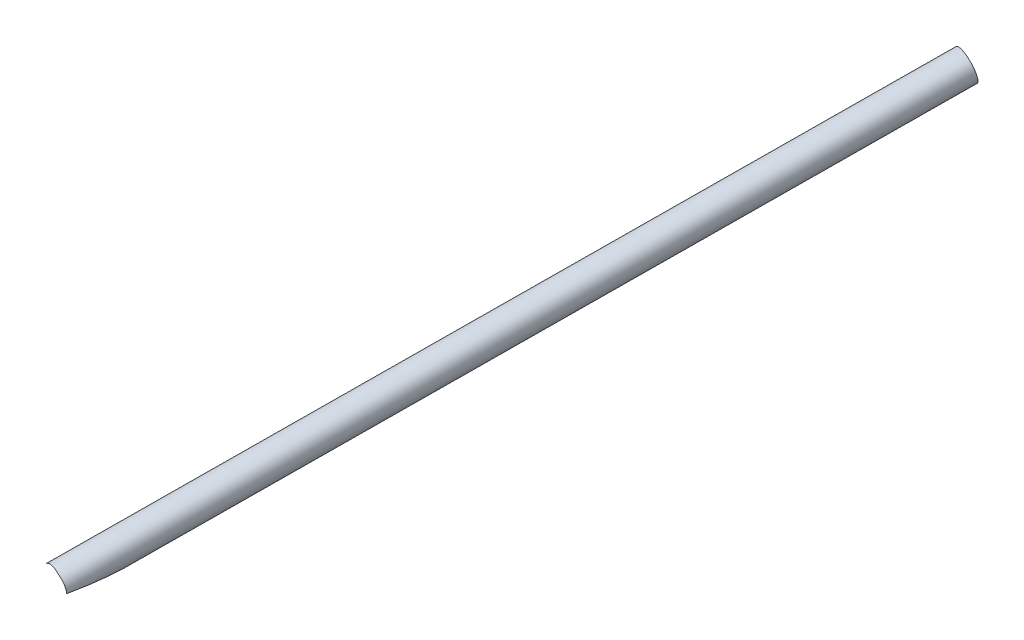
ISO-10303-21;
HEADER;
FILE_DESCRIPTION(('STEP AP214'),'2;1');
FILE_NAME('part.step','',(''),(''),'','','');
FILE_SCHEMA(('AUTOMOTIVE_DESIGN { 1 0 10303 214 1 1 1 1 }'));
ENDSEC;
DATA;
#1=APPLICATION_CONTEXT('core data for automotive mechanical design processes');
#2=APPLICATION_PROTOCOL_DEFINITION('international standard','automotive_design',2000,#1);
#3=PRODUCT_CONTEXT('',#1,'mechanical');
#4=PRODUCT('Part','Part','',(#3));
#5=PRODUCT_RELATED_PRODUCT_CATEGORY('part','',(#4));
#6=PRODUCT_DEFINITION_FORMATION('','',#4);
#7=PRODUCT_DEFINITION_CONTEXT('part definition',#1,'design');
#8=PRODUCT_DEFINITION('design','',#6,#7);
#9=PRODUCT_DEFINITION_SHAPE('','',#8);
#10=(LENGTH_UNIT() NAMED_UNIT(*) SI_UNIT(.MILLI.,.METRE.));
#11=(NAMED_UNIT(*) PLANE_ANGLE_UNIT() SI_UNIT($,.RADIAN.));
#12=(NAMED_UNIT(*) SI_UNIT($,.STERADIAN.) SOLID_ANGLE_UNIT());
#13=UNCERTAINTY_MEASURE_WITH_UNIT(LENGTH_MEASURE(1.E-05),#10,'distance_accuracy_value','');
#14=(GEOMETRIC_REPRESENTATION_CONTEXT(3) GLOBAL_UNCERTAINTY_ASSIGNED_CONTEXT((#13)) GLOBAL_UNIT_ASSIGNED_CONTEXT((#10,
#11,#12)) REPRESENTATION_CONTEXT('',''));
#15=CARTESIAN_POINT('',(0.,0.,0.));
#16=DIRECTION('',(0.,0.,1.));
#17=DIRECTION('',(1.,0.,0.));
#18=AXIS2_PLACEMENT_3D('',#15,#16,#17);
#19=CARTESIAN_POINT('',(74.,0.,457.2));
#20=DIRECTION('',(0.,0.,-1.));
#21=DIRECTION('',(-1.,0.,0.));
#22=AXIS2_PLACEMENT_3D('',#19,#20,#21);
#23=CYLINDRICAL_SURFACE('',#22,9.52500000000001);
#24=CARTESIAN_POINT('',(74.,0.,457.2));
#25=DIRECTION('',(0.13875217529052,0.133928158846882,-0.981229372837989));
#26=DIRECTION('',(0.705998161317945,0.68145262369127,0.192844284022023));
#27=AXIS2_PLACEMENT_3D('',#24,#25,#26);
#28=ELLIPSE('',#27,9.70721042772196,9.525);
#29=CARTESIAN_POINT('',(83.524271376684,-0.117812322268082,458.530713307516));
#30=VERTEX_POINT('',#29);
#31=CARTESIAN_POINT('',(78.3709263667531,8.462897121933,458.973179462046));
#32=VERTEX_POINT('',#31);
#33=EDGE_CURVE('E73',#30,#32,#28,.F.);
#34=ORIENTED_EDGE('',*,*,#33,.T.);
#35=CARTESIAN_POINT('',(74.,0.,457.2));
#36=DIRECTION('',(-0.863745042896468,0.478942715409442,-0.156711123498012));
#37=DIRECTION('',(-0.137051802029349,0.0759946036802452,0.987644482479394));
#38=AXIS2_PLACEMENT_3D('',#35,#36,#37);
#39=ELLIPSE('',#38,60.7806248043446,9.525);
#40=CARTESIAN_POINT('',(78.6189994934439,8.33009415790513,457.2));
#41=VERTEX_POINT('',#40);
#42=EDGE_CURVE('E81',#41,#32,#39,.F.);
#43=ORIENTED_EDGE('',*,*,#42,.F.);
#44=CARTESIAN_POINT('',(74.,0.,457.2));
#45=DIRECTION('',(-0.137051802029349,0.0759946036802452,0.987644482479394));
#46=DIRECTION('',(-0.863745042896468,0.478942715409442,-0.156711123498012));
#47=AXIS2_PLACEMENT_3D('',#44,#45,#46);
#48=ELLIPSE('',#47,9.64415857018543,9.525);
#49=EDGE_CURVE('E46',#30,#41,#48,.T.);
#50=ORIENTED_EDGE('',*,*,#49,.F.);
#51=EDGE_LOOP('',(#34,#43,#50));
#52=FACE_BOUND('',#51,.T.);
#53=ADVANCED_FACE('F36',(#52),#23,.F.);
#54=CARTESIAN_POINT('',(204.165057136812,-72.1759348192314,0.));
#55=DIRECTION('',(-0.270716912176289,0.150111302046005,0.950883247543982));
#56=DIRECTION('',(0.961781089140046,0.,0.273819532854372));
#57=AXIS2_PLACEMENT_3D('',#54,#55,#56);
#58=CYLINDRICAL_SURFACE('',#57,9.52499999999999);
#59=CARTESIAN_POINT('',(73.9999999999999,0.,457.2));
#60=DIRECTION('',(0.277508363855037,0.0576045139736906,-0.958994696523581));
#61=DIRECTION('',(0.00381544954876417,0.998126854994749,0.061059181807759));
#62=AXIS2_PLACEMENT_3D('',#59,#60,#61);
#63=ELLIPSE('',#62,9.73556956140376,9.52499999999999);
#64=CARTESIAN_POINT('',(67.5903171408937,7.0456788633656,455.768419928183));
#65=VERTEX_POINT('',#64);
#66=EDGE_CURVE('E83',#32,#65,#63,.F.);
#67=ORIENTED_EDGE('',*,*,#66,.T.);
#68=CARTESIAN_POINT('',(74.,0.,457.2));
#69=DIRECTION('',(-0.137051802029349,0.0759946036802452,0.987644482479394));
#70=DIRECTION('',(-0.863745042896468,0.478942715409442,-0.156711123498012));
#71=AXIS2_PLACEMENT_3D('',#68,#69,#70);
#72=ELLIPSE('',#71,9.64415857018543,9.525);
#73=EDGE_CURVE('E79',#65,#41,#72,.F.);
#74=ORIENTED_EDGE('',*,*,#73,.T.);
#75=ORIENTED_EDGE('',*,*,#42,.T.);
#76=EDGE_LOOP('',(#67,#74,#75));
#77=FACE_BOUND('',#76,.T.);
#78=ADVANCED_FACE('F80',(#77),#58,.F.);
#79=CARTESIAN_POINT('',(74.,0.,457.2));
#80=DIRECTION('',(-0.863745042896468,0.478942715409442,-0.156711123498012));
#81=DIRECTION('',(-0.137051802029349,0.0759946036802452,0.987644482479394));
#82=AXIS2_PLACEMENT_3D('',#79,#80,#81);
#83=ELLIPSE('',#82,60.7806248043446,9.525);
#84=CARTESIAN_POINT('',(79.5287224915534,7.75621380645162,450.431976644682));
#85=VERTEX_POINT('',#84);
#86=EDGE_CURVE('E11',#41,#85,#83,.T.);
#87=ORIENTED_EDGE('',*,*,#86,.F.);
#88=ORIENTED_EDGE('',*,*,#73,.F.);
#89=CARTESIAN_POINT('',(74.,0.,457.2));
#90=DIRECTION('',(0.705998161317945,0.68145262369127,0.192844284022023));
#91=DIRECTION('',(0.13875217529052,0.133928158846882,-0.981229372837989));
#92=AXIS2_PLACEMENT_3D('',#89,#90,#91);
#93=ELLIPSE('',#92,49.3921821344324,9.525);
#94=CARTESIAN_POINT('',(83.1702232239573,2.57538948953245,414.527401735599));
#95=VERTEX_POINT('',#94);
#96=EDGE_CURVE('E93',#65,#95,#93,.F.);
#97=ORIENTED_EDGE('',*,*,#96,.T.);
#98=CARTESIAN_POINT('',(82.7114157115385,3.85186465244558,420.957393255547));
#99=VERTEX_POINT('',#98);
#100=EDGE_CURVE('E48',#99,#95,#83,.T.);
#101=ORIENTED_EDGE('',*,*,#100,.F.);
#102=CARTESIAN_POINT('',(77.2019323266206,8.97068862327423,423.815193677804));
#103=CARTESIAN_POINT('',(77.2582453246513,8.95058853907599,423.623768086207));
#104=CARTESIAN_POINT('',(77.3156960722595,8.92948689502026,423.432782136425));
#105=CARTESIAN_POINT('',(77.433060454762,8.88502363268686,423.05183856267));
#106=CARTESIAN_POINT('',(77.492974078138,8.86166202497786,422.861880933893));
#107=CARTESIAN_POINT('',(77.676800173501,8.78773823119261,422.29353625416));
#108=CARTESIAN_POINT('',(77.80473351631,8.73335958175288,421.916898118422));
#109=CARTESIAN_POINT('',(78.0065052797062,8.64169779918439,421.357267226058));
#110=CARTESIAN_POINT('',(78.0753920482474,8.60946953628256,421.171650417581));
#111=CARTESIAN_POINT('',(78.216932717674,8.54103628661163,420.802605822612));
#112=CARTESIAN_POINT('',(78.2895862446428,8.50483169416526,420.619177821058));
#113=CARTESIAN_POINT('',(78.4391731200471,8.42771861461959,420.255281949541));
#114=CARTESIAN_POINT('',(78.5161021990192,8.38681477800532,420.074811351601));
#115=CARTESIAN_POINT('',(78.6750637039184,8.2992563407835,419.717572753102));
#116=CARTESIAN_POINT('',(78.7570947349651,8.25260330862021,419.540803758032));
#117=CARTESIAN_POINT('',(78.9063345641259,8.16449865335921,419.235315913789));
#118=CARTESIAN_POINT('',(78.9722084523369,8.12460254396375,419.105499996946));
#119=CARTESIAN_POINT('',(79.1081019048957,8.03985980846844,418.849594404181));
#120=CARTESIAN_POINT('',(79.1781233140627,7.99501097160943,418.723506424401));
#121=CARTESIAN_POINT('',(79.322726670347,7.89947391141685,418.477052920582));
#122=CARTESIAN_POINT('',(79.3972867140129,7.84881282912531,418.3566642314));
#123=CARTESIAN_POINT('',(79.5521502037322,7.74003995571987,418.12323972409));
#124=CARTESIAN_POINT('',(79.6324472672418,7.68193638914895,418.010195993974));
#125=CARTESIAN_POINT('',(79.7818324367592,7.56985829486777,417.818235894769));
#126=CARTESIAN_POINT('',(79.8495817474637,7.51771490905937,417.737230717919));
#127=CARTESIAN_POINT('',(79.9900018982504,7.4063180292652,417.584469421442));
#128=CARTESIAN_POINT('',(80.0626798543215,7.34705415522925,417.51272712871));
#129=CARTESIAN_POINT('',(80.2141382335726,7.21942241474177,417.381843511211));
#130=CARTESIAN_POINT('',(80.2929894016671,7.15093952124259,417.322891067994));
#131=CARTESIAN_POINT('',(80.4548677490442,7.00514182730188,417.225171358948));
#132=CARTESIAN_POINT('',(80.5378776381085,6.92786213049326,417.186327073345));
#133=CARTESIAN_POINT('',(80.6808209510835,6.78963135976581,417.142412066861));
#134=CARTESIAN_POINT('',(80.7404577560534,6.73045291489592,417.130810387146));
#135=CARTESIAN_POINT('',(80.8586461885498,6.60996956414668,417.12207600484));
#136=CARTESIAN_POINT('',(80.9171981973866,6.54866542808202,417.124938117461));
#137=CARTESIAN_POINT('',(81.0313399461413,6.42595532276687,417.144780211541));
#138=CARTESIAN_POINT('',(81.0869369592724,6.36455002750681,417.161723641955));
#139=CARTESIAN_POINT('',(81.1942347102805,6.24301261515318,417.207940106066));
#140=CARTESIAN_POINT('',(81.24593161461,6.18288179146174,417.237225089216));
#141=CARTESIAN_POINT('',(81.3720384283591,6.03265052858207,417.324553823427));
#142=CARTESIAN_POINT('',(81.4434380849752,5.94411251222984,417.389569551257));
#143=CARTESIAN_POINT('',(81.5765953643925,5.77344250841003,417.535832446023));
#144=CARTESIAN_POINT('',(81.6383228960687,5.69133089586308,417.617128543465));
#145=CARTESIAN_POINT('',(81.7515906085927,5.53600520942364,417.78745435746));
#146=CARTESIAN_POINT('',(81.8034131330904,5.46257955815233,417.876110587227));
#147=CARTESIAN_POINT('',(81.9008882633925,5.32062115656451,418.060520172033));
#148=CARTESIAN_POINT('',(81.9465345596184,5.25209344314336,418.156280632399));
#149=CARTESIAN_POINT('',(82.0328321654372,5.11913305499508,418.353087613908));
#150=CARTESIAN_POINT('',(82.073471489633,5.05471037789585,418.454146023905));
#151=CARTESIAN_POINT('',(82.1504885754607,4.92955823924887,418.659995783477));
#152=CARTESIAN_POINT('',(82.1868683204977,4.86882706519711,418.764785365809));
#153=CARTESIAN_POINT('',(82.2814231154575,4.70720770766816,419.054995101515));
#154=CARTESIAN_POINT('',(82.3360671713861,4.60945344426336,419.243306524779));
#155=CARTESIAN_POINT('',(82.4373278570333,4.42136707007328,419.625750613381));
#156=CARTESIAN_POINT('',(82.4839395670965,4.33103952559088,419.819886761396));
#157=CARTESIAN_POINT('',(82.5708868023981,4.15632741103509,420.212651127938));
#158=CARTESIAN_POINT('',(82.6112097034369,4.07195497642624,420.411287488097));
#159=CARTESIAN_POINT('',(82.6866846567307,3.90835521398599,420.811642636877));
#160=CARTESIAN_POINT('',(82.7218361038485,3.82912848888421,421.013361783187));
#161=CARTESIAN_POINT('',(82.7880320009092,3.67467182328963,421.420298885957));
#162=CARTESIAN_POINT('',(82.8190524449883,3.59946664553911,421.625530083397));
#163=CARTESIAN_POINT('',(82.8774342958865,3.45296960278135,422.037903445945));
#164=CARTESIAN_POINT('',(82.9047955340831,3.38167791820369,422.245045698647));
#165=CARTESIAN_POINT('',(82.9563484901951,3.24267368466459,422.660602638441));
#166=CARTESIAN_POINT('',(82.9805443936316,3.17495648135861,422.869015255905));
#167=CARTESIAN_POINT('',(83.026223096186,3.04266561824538,423.287125587249));
#168=CARTESIAN_POINT('',(83.0477059121329,2.97809193894053,423.496823293149));
#169=CARTESIAN_POINT('',(83.0977803607763,2.82232154629912,424.01553270863));
#170=CARTESIAN_POINT('',(83.1250043521465,2.7327806475332,424.325174207659));
#171=CARTESIAN_POINT('',(83.1751860260463,2.55924468582513,424.946359797836));
#172=CARTESIAN_POINT('',(83.198143458543,2.47524994808991,425.257903999383));
#173=CARTESIAN_POINT('',(83.2404434141823,2.31233964767079,425.882629060931));
#174=CARTESIAN_POINT('',(83.2597851765922,2.23342515614921,426.195810251136));
#175=CARTESIAN_POINT('',(83.2953659482959,2.08037441432805,426.823516580461));
#176=CARTESIAN_POINT('',(83.3116048719953,2.00623829588124,427.138041756411));
#177=CARTESIAN_POINT('',(83.3563769886542,1.79039784117408,428.084443786789));
#178=CARTESIAN_POINT('',(83.3808966709487,1.65553683364802,428.718083046673));
#179=CARTESIAN_POINT('',(83.4219291188913,1.40326069864283,429.988970992103));
#180=CARTESIAN_POINT('',(83.4384428913441,1.28584337877428,430.626219213591));
#181=CARTESIAN_POINT('',(83.465424421208,1.06921519973738,431.901239400471));
#182=CARTESIAN_POINT('',(83.4759167118716,0.969931603136484,432.538998484778));
#183=CARTESIAN_POINT('',(83.4925820235148,0.79033989805229,433.817351332548));
#184=CARTESIAN_POINT('',(83.4987545160291,0.710034112027067,434.457945433189));
#185=CARTESIAN_POINT('',(83.505771563976,0.605913915847475,435.420131731729));
#186=CARTESIAN_POINT('',(83.5077363551609,0.57394740685271,435.740845089477));
#187=CARTESIAN_POINT('',(83.5110610135779,0.515936370873241,436.38280700797));
#188=CARTESIAN_POINT('',(83.5124208981411,0.489891674234836,436.704055553116));
#189=CARTESIAN_POINT('',(83.5146573372045,0.444342678657306,437.346952866403));
#190=CARTESIAN_POINT('',(83.5155339930849,0.424837008184285,437.668601536396));
#191=CARTESIAN_POINT('',(83.5168966614037,0.393138166684606,438.312251171704));
#192=CARTESIAN_POINT('',(83.5173826963817,0.380944573748281,438.634252115618));
#193=CARTESIAN_POINT('',(83.517892743951,0.367921310743764,439.155551412124));
#194=CARTESIAN_POINT('',(83.5180222865139,0.364530827639101,439.354786538942));
#195=CARTESIAN_POINT('',(83.5181487190126,0.361205661795665,439.753281745403));
#196=CARTESIAN_POINT('',(83.5181456104784,0.361270939197606,439.952541824732));
#197=CARTESIAN_POINT('',(83.5179252115753,0.367113543718901,440.550354249888));
#198=CARTESIAN_POINT('',(83.5174967845981,0.378539342250088,440.948878116047));
#199=CARTESIAN_POINT('',(83.5157766626272,0.419584634570394,441.745007449886));
#200=CARTESIAN_POINT('',(83.5144850015006,0.449203414597192,442.142612952983));
#201=CARTESIAN_POINT('',(83.5102922493106,0.530771333370125,442.935528365144));
#202=CARTESIAN_POINT('',(83.5073916383984,0.582713809121414,443.330838923532));
#203=CARTESIAN_POINT('',(83.4997233678079,0.694979242714262,444.001393710311));
#204=CARTESIAN_POINT('',(83.495754276429,0.74836019916164,444.27780173081));
#205=CARTESIAN_POINT('',(83.4852709655601,0.871263454524018,444.827062491189));
#206=CARTESIAN_POINT('',(83.4787564177075,0.940787835463329,445.099914767686));
#207=CARTESIAN_POINT('',(83.4617928958086,1.09835210156893,445.639572377713));
#208=CARTESIAN_POINT('',(83.4513518126833,1.18635469656075,445.906388708728));
#209=CARTESIAN_POINT('',(83.424508082202,1.38355059062307,446.431769797377));
#210=CARTESIAN_POINT('',(83.4081086219855,1.49273254631544,446.690338886182));
#211=CARTESIAN_POINT('',(83.3736406553321,1.69320687845288,447.109286202414));
#212=CARTESIAN_POINT('',(83.3580541188652,1.77787792869287,447.273045058457));
#213=CARTESIAN_POINT('',(83.3220809497878,1.95776844306196,447.594093054341));
#214=CARTESIAN_POINT('',(83.3016958576807,2.05298451668718,447.75138425153));
#215=CARTESIAN_POINT('',(83.2550210397623,2.25407457227907,448.058032321991));
#216=CARTESIAN_POINT('',(83.2287335154887,2.35994457235278,448.207392127961));
#217=CARTESIAN_POINT('',(83.1690559186047,2.58210398510417,448.496687411499));
#218=CARTESIAN_POINT('',(83.1356658444275,2.69839340008036,448.636622886989));
#219=CARTESIAN_POINT('',(83.0601681907058,2.94200778570272,448.907006035875));
#220=CARTESIAN_POINT('',(83.0179672089215,3.06944171923106,449.037329964233));
#221=CARTESIAN_POINT('',(82.9239440730185,3.3329265580848,449.285218144048));
#222=CARTESIAN_POINT('',(82.8721216622019,3.4689776932517,449.402782054937));
#223=CARTESIAN_POINT('',(82.757947129451,3.74788966112083,449.623798545172));
#224=CARTESIAN_POINT('',(82.6955986053883,3.89074815510282,449.727255924423));
#225=CARTESIAN_POINT('',(82.5597233319026,4.18120110477211,449.919071370336));
#226=CARTESIAN_POINT('',(82.4861984432812,4.32879476885901,450.007431945338));
#227=CARTESIAN_POINT('',(82.3397028603691,4.60385275933425,450.15614681149));
#228=CARTESIAN_POINT('',(82.2683350376938,4.73097989951122,450.218715939122));
#229=CARTESIAN_POINT('',(82.1173742107008,4.98555407252212,450.332192155273));
#230=CARTESIAN_POINT('',(82.0377818223245,5.1130010807045,450.383100116185));
#231=CARTESIAN_POINT('',(81.8705963807179,5.36678913456969,450.473067677865));
#232=CARTESIAN_POINT('',(81.7830046884176,5.49313036438654,450.512129289196));
#233=CARTESIAN_POINT('',(81.6001961460027,5.74340077685514,450.578318706707));
#234=CARTESIAN_POINT('',(81.5049794484086,5.86733000769168,450.605446751521));
#235=CARTESIAN_POINT('',(81.3138232809012,6.10370529580737,450.646364792008));
#236=CARTESIAN_POINT('',(81.218322111498,6.2163779692722,450.660898859311));
#237=CARTESIAN_POINT('',(81.0217171502655,6.4376246316283,450.679459570773));
#238=CARTESIAN_POINT('',(80.9206135119692,6.54619873270194,450.683486502729));
#239=CARTESIAN_POINT('',(80.7135214092824,6.75841944857196,450.681029646677));
#240=CARTESIAN_POINT('',(80.6075338406395,6.86206695991156,450.674547778662));
#241=CARTESIAN_POINT('',(80.391464165475,7.06375620559724,450.651083009695));
#242=CARTESIAN_POINT('',(80.2813820240722,7.1617978921699,450.634100019266));
#243=CARTESIAN_POINT('',(80.0587174285713,7.35110830487095,450.589788424236));
#244=CARTESIAN_POINT('',(79.9461542649246,7.4424146142699,450.562523401563));
#245=CARTESIAN_POINT('',(79.7188763237379,7.61844729219751,450.497684463055));
#246=CARTESIAN_POINT('',(79.6041615842776,7.70317377704309,450.46011072951));
#247=CARTESIAN_POINT('',(79.373663373079,7.86570091601682,450.374746146584));
#248=CARTESIAN_POINT('',(79.2578800710772,7.9435026499035,450.32695689405));
#249=CARTESIAN_POINT('',(79.0263503986541,8.09199246704022,450.221304572598));
#250=CARTESIAN_POINT('',(78.9106040283111,8.16268053530551,450.163441482461));
#251=CARTESIAN_POINT('',(78.6797542799566,8.29719576844263,450.037573961966));
#252=CARTESIAN_POINT('',(78.5646565352304,8.36098888956545,449.969522844664));
#253=CARTESIAN_POINT('',(78.3368185128004,8.48140529801172,449.823821388728));
#254=CARTESIAN_POINT('',(78.2240782186739,8.5380286352956,449.746171116989));
#255=CARTESIAN_POINT('',(78.0020720997158,8.64431552778063,449.58173838699));
#256=CARTESIAN_POINT('',(77.8928056721999,8.69398029538061,449.494957524186));
#257=CARTESIAN_POINT('',(77.6786804735311,8.7867261420607,449.312793882081));
#258=CARTESIAN_POINT('',(77.5738233274296,8.82980480897049,449.217407971407));
#259=CARTESIAN_POINT('',(77.3650268520422,8.91152774524813,449.014480820408));
#260=CARTESIAN_POINT('',(77.2613181128698,8.94990394480626,448.906594376698));
#261=CARTESIAN_POINT('',(77.0603597586545,9.02059657375001,448.683071751135));
#262=CARTESIAN_POINT('',(76.9631126480496,9.05291066229125,448.567432598923));
#263=CARTESIAN_POINT('',(76.6819428360483,9.1417485885295,448.21028325692));
#264=CARTESIAN_POINT('',(76.5084535670314,9.19021985907258,447.958406216466));
#265=CARTESIAN_POINT('',(76.2217192922986,9.26320748217679,447.485427917167));
#266=CARTESIAN_POINT('',(76.1033113153208,9.29054307234018,447.26778747035));
#267=CARTESIAN_POINT('',(75.8847531384297,9.33733501192001,446.822591464673));
#268=CARTESIAN_POINT('',(75.784613599021,9.35678676877996,446.595030211896));
#269=CARTESIAN_POINT('',(75.6010582360694,9.38993897896646,446.132210053456));
#270=CARTESIAN_POINT('',(75.5176896932137,9.40362328830672,445.89693150148));
#271=CARTESIAN_POINT('',(75.3662823369831,9.42680966935044,445.42139049808));
#272=CARTESIAN_POINT('',(75.298241146708,9.43631238973507,445.181128825735));
#273=CARTESIAN_POINT('',(75.1623864377222,9.45410850790979,444.644601484119));
#274=CARTESIAN_POINT('',(75.0978254726121,9.46169216014439,444.347495262506));
#275=CARTESIAN_POINT('',(74.9857312351407,9.47402254639027,443.749976638594));
#276=CARTESIAN_POINT('',(74.9382051219571,9.4787680881976,443.449562900796));
#277=CARTESIAN_POINT('',(74.8575656778464,9.48640281016057,442.846323039493));
#278=CARTESIAN_POINT('',(74.8244759539894,9.48928895338494,442.543493783152));
#279=CARTESIAN_POINT('',(74.7706611057414,9.49380978671226,441.936798548698));
#280=CARTESIAN_POINT('',(74.7499343554825,9.49544464138152,441.632932712195));
#281=CARTESIAN_POINT('',(74.7189739100484,9.49783860422012,441.022880387211));
#282=CARTESIAN_POINT('',(74.7088029897125,9.49859247654633,440.716690801509));
#283=CARTESIAN_POINT('',(74.6977061245265,9.49941352720447,440.10415035814));
#284=CARTESIAN_POINT('',(74.6967803802294,9.49948069063981,439.79779949712));
#285=CARTESIAN_POINT('',(74.7029849634262,9.49902338167445,439.18547792423));
#286=CARTESIAN_POINT('',(74.7101076753535,9.49849946855974,438.879507126782));
#287=CARTESIAN_POINT('',(74.7314486510812,9.49687932108415,438.267809545036));
#288=CARTESIAN_POINT('',(74.7456672526266,9.49578305948092,437.962082773047));
#289=CARTESIAN_POINT('',(74.7964020831977,9.49170765880549,437.06958381708));
#290=CARTESIAN_POINT('',(74.8413937602238,9.48792427893149,436.48328908884));
#291=CARTESIAN_POINT('',(74.9505872209364,9.47760508775082,435.312496996078));
#292=CARTESIAN_POINT('',(75.0147914481667,9.47106892628913,434.727999869742));
#293=CARTESIAN_POINT('',(75.1599089385018,9.45439482616226,433.56052606212));
#294=CARTESIAN_POINT('',(75.2408395717236,9.44425313526145,432.977551604559));
#295=CARTESIAN_POINT('',(75.4177662455116,9.41931797753448,431.814039421862));
#296=CARTESIAN_POINT('',(75.5137613385802,9.40452480321038,431.233501545831));
#297=CARTESIAN_POINT('',(75.7197160433872,9.36905034962404,430.076887228077));
#298=CARTESIAN_POINT('',(75.8296328080799,9.3483869046171,429.500802620892));
#299=CARTESIAN_POINT('',(76.0635834828524,9.29954506972468,428.351769485196));
#300=CARTESIAN_POINT('',(76.1876186225052,9.27136602501611,427.778821234393));
#301=CARTESIAN_POINT('',(76.4502947681796,9.2054372488065,426.637498547669));
#302=CARTESIAN_POINT('',(76.5889185325926,9.16769874255534,426.069119548393));
#303=CARTESIAN_POINT('',(76.809097040339,9.10167151385638,425.220520213344));
#304=CARTESIAN_POINT('',(76.8845247957886,9.07809445367771,424.938334390898));
#305=CARTESIAN_POINT('',(77.0398029767199,9.02728707906016,424.375517464953));
#306=CARTESIAN_POINT('',(77.1196532043266,9.00005692799435,424.09488629251));
#307=CARTESIAN_POINT('',(77.2019323266206,8.97068862327423,423.815193677804));
#308=B_SPLINE_CURVE_WITH_KNOTS('',3,(#102,#103,#104,#105,#106,#107,#108,#109,#110,#111,#112,
#113,#114,#115,#116,#117,#118,#119,#120,#121,#122,#123,#124,#125,#126,#127,#128,#129,#130,#131,
#132,#133,#134,#135,#136,#137,#138,#139,#140,#141,#142,#143,#144,#145,#146,#147,#148,#149,#150,
#151,#152,#153,#154,#155,#156,#157,#158,#159,#160,#161,#162,#163,#164,#165,#166,#167,#168,#169,
#170,#171,#172,#173,#174,#175,#176,#177,#178,#179,#180,#181,#182,#183,#184,#185,#186,#187,#188,
#189,#190,#191,#192,#193,#194,#195,#196,#197,#198,#199,#200,#201,#202,#203,#204,#205,#206,#207,
#208,#209,#210,#211,#212,#213,#214,#215,#216,#217,#218,#219,#220,#221,#222,#223,#224,#225,#226,
#227,#228,#229,#230,#231,#232,#233,#234,#235,#236,#237,#238,#239,#240,#241,#242,#243,#244,#245,
#246,#247,#248,#249,#250,#251,#252,#253,#254,#255,#256,#257,#258,#259,#260,#261,#262,#263,#264,
#265,#266,#267,#268,#269,#270,#271,#272,#273,#274,#275,#276,#277,#278,#279,#280,#281,#282,#283,
#284,#285,#286,#287,#288,#289,#290,#291,#292,#293,#294,#295,#296,#297,#298,#299,#300,#301,#302,
#303,#304,#305,#306,#307),.UNSPECIFIED.,.T.,.F.,(4,2,2,2,2,2,2,2,2,2,2,2,2,2,2,2,2,2,2,2,2,2,2,
2,2,2,2,2,2,2,2,2,2,2,2,2,2,2,2,2,2,2,2,2,2,2,2,2,2,2,2,2,2,2,2,2,2,2,2,2,2,2,2,2,2,2,2,2,2,2,2,
2,2,2,2,2,2,2,2,2,2,2,2,2,2,2,2,2,2,2,2,2,2,2,2,2,2,2,2,2,2,2,4),(0.,0.601628842569739,
1.20325487177172,2.40719957967631,3.00891477542106,3.61057035434911,4.21163556771871,
4.81253716534798,5.26521805162652,5.71810182506081,6.16895084154884,6.61930586397864,
6.97212404109332,7.32546293365234,7.68371001123899,8.04057455728719,8.29383942315948,
8.54701350844404,8.79953247177287,9.05229649512376,9.44306877063118,9.83503362771539,
10.2131857633692,10.5917213451271,10.9711461292258,11.350393531642,12.007153780221,
12.664314862903,13.3227786112923,13.9813193485829,14.6435339132954,15.30577898347,
15.9671393201057,16.6284955541533,17.5988221581555,18.5692056081871,19.5397929964863,
20.5104071553796,22.4549376818886,24.399223605221,26.3355306576589,28.2720745480534,
29.2389558570608,30.2058094624438,31.1724601471856,32.1390550504453,32.7368191712231,
33.3345763972969,34.530272816957,35.7259223290474,36.9212152209792,37.765447149945,
38.6097880203966,39.4524410596473,40.2946440252724,40.8492707547042,41.4037196718774,
41.9579621286478,42.5122047076832,43.0726516484625,43.6331135440105,44.1933842576462,
44.753561791338,45.2288912436819,45.7041851241551,46.1793982924927,46.6546019576748,
47.0993177539469,47.5440213690248,47.9886437444309,48.4332699083896,48.8751905207172,
49.317103319075,49.7589470899523,50.2007917915424,50.6447270158689,51.0886591465991,
51.5325138341338,51.9765306967468,52.4395167174505,52.9026811508272,53.8284161383977,
54.5752286182134,55.322475514361,56.0718003985389,56.8210090004988,57.7327746500172,
58.6449230360481,59.5585574702556,60.4720717249065,61.3909879911736,62.3099241912038,
63.2279916080017,64.1461027264881,65.9097626065415,67.6736468926888,69.4393722336792,
71.204986561689,72.9652931752957,74.7257532119539,76.4841555250146,77.3632368740018,
78.2422789219223),.UNSPECIFIED.);
#309=EDGE_CURVE('E55',#85,#99,#308,.T.);
#310=ORIENTED_EDGE('',*,*,#309,.F.);
#311=EDGE_LOOP('',(#87,#88,#97,#101,#310));
#312=FACE_BOUND('',#311,.T.);
#313=ADVANCED_FACE('F95',(#312),#23,.F.);
#314=CARTESIAN_POINT('',(73.9999999999999,0.,457.2));
#315=DIRECTION('',(0.272295419880448,0.262828486621345,-0.925622164240066));
#316=DIRECTION('',(-0.959350460020585,0.,-0.282217460229329));
#317=AXIS2_PLACEMENT_3D('',#314,#315,#316);
#318=CYLINDRICAL_SURFACE('',#317,6.35);
#319=CARTESIAN_POINT('',(205.569535884325,126.995239277739,9.95164522862782));
#320=DIRECTION('',(-0.272295419880447,-0.262828486621343,0.925622164240067));
#321=DIRECTION('',(0.959350460020585,0.,0.282217460229327));
#322=AXIS2_PLACEMENT_3D('',#319,#320,#321);
#323=CIRCLE('',#322,6.35000000000001);
#324=CARTESIAN_POINT('',(211.661411305456,126.995239277739,11.7437261010841));
#325=VERTEX_POINT('',#324);
#326=EDGE_CURVE('E169',#325,#325,#323,.F.);
#327=ORIENTED_EDGE('',*,*,#326,.T.);
#328=EDGE_LOOP('',(#327));
#329=FACE_BOUND('',#328,.T.);
#330=ORIENTED_EDGE('',*,*,#309,.T.);
#331=CARTESIAN_POINT('',(72.768411043796,4.69130820005628,438.886198422629));
#332=CARTESIAN_POINT('',(72.8429623082622,4.65320442096803,438.632776178618));
#333=CARTESIAN_POINT('',(72.9201516056793,4.61736160799996,438.379796411605));
#334=CARTESIAN_POINT('',(73.0792193327786,4.54969552012651,437.874770698058));
#335=CARTESIAN_POINT('',(73.1610979574733,4.51787241256308,437.622724790825));
#336=CARTESIAN_POINT('',(73.4130773877731,4.42773928213696,436.867948829985));
#337=CARTESIAN_POINT('',(73.5894926748192,4.37477975355375,436.366678074947));
#338=CARTESIAN_POINT('',(73.9568168737124,4.28015064300294,435.367745919344));
#339=CARTESIAN_POINT('',(74.1477435784361,4.23849521679352,434.87008979693));
#340=CARTESIAN_POINT('',(74.5425187576747,4.16433718458978,433.879315218639));
#341=CARTESIAN_POINT('',(74.7463658473011,4.13183359966885,433.386196282905));
#342=CARTESIAN_POINT('',(75.1678263688694,4.07405021848842,432.401505651646));
#343=CARTESIAN_POINT('',(75.3855234518543,4.04882067488901,431.909966879654));
#344=CARTESIAN_POINT('',(75.8334976579818,4.0044961652831,430.9323388403));
#345=CARTESIAN_POINT('',(76.0637755155342,3.98540155785567,430.446249893074));
#346=CARTESIAN_POINT('',(76.5372742326264,3.95226423711709,429.480958355454));
#347=CARTESIAN_POINT('',(76.7804793326226,3.93821552748651,429.001748245366));
#348=CARTESIAN_POINT('',(77.2813776889555,3.91423803466263,428.050880441803));
#349=CARTESIAN_POINT('',(77.5390693412343,3.90430879634738,427.579221919563));
#350=CARTESIAN_POINT('',(77.9377742836079,3.89194361393608,426.879510726517));
#351=CARTESIAN_POINT('',(78.0725056502677,3.88824676674698,426.647890392093));
#352=CARTESIAN_POINT('',(78.3465320600084,3.8816016338179,426.187358112409));
#353=CARTESIAN_POINT('',(78.4858269452223,3.87865332221444,425.958446073833));
#354=CARTESIAN_POINT('',(78.7696454457529,3.87341766606258,425.503487229175));
#355=CARTESIAN_POINT('',(78.9141752048868,3.87113112846892,425.277444239856));
#356=CARTESIAN_POINT('',(79.2089335342968,3.86714018699203,424.829103886261));
#357=CARTESIAN_POINT('',(79.3591618449658,3.86543575662522,424.606806352018));
#358=CARTESIAN_POINT('',(79.6647379237004,3.86253578043729,424.168769346936));
#359=CARTESIAN_POINT('',(79.8200260114612,3.86133570526267,423.952988399208));
#360=CARTESIAN_POINT('',(80.1380573600872,3.85933108630039,423.526997071626));
#361=CARTESIAN_POINT('',(80.3007997935998,3.85852649873356,423.316786077634));
#362=CARTESIAN_POINT('',(80.6348817045658,3.8572086388493,422.903909664366));
#363=CARTESIAN_POINT('',(80.8062050790633,3.85669484160005,422.701231269518));
#364=CARTESIAN_POINT('',(81.1596199879411,3.85582722722494,422.305546872659));
#365=CARTESIAN_POINT('',(81.3417050649619,3.85547331524312,422.112535196222));
#366=CARTESIAN_POINT('',(81.6050703993343,3.85496490954781,421.853080558102));
#367=CARTESIAN_POINT('',(81.6806037215195,3.85481947337103,421.780787757132));
#368=CARTESIAN_POINT('',(81.8340420745935,3.85450987170509,421.638739464678));
#369=CARTESIAN_POINT('',(81.9119473139871,3.85434570456585,421.568984197447));
#370=CARTESIAN_POINT('',(82.0706340336482,3.85398069069408,421.43227778326));
#371=CARTESIAN_POINT('',(82.1514240856021,3.85377972578355,421.365336550853));
#372=CARTESIAN_POINT('',(82.3159322753934,3.85331970156109,421.235146829101));
#373=CARTESIAN_POINT('',(82.3996502204991,3.85306064606699,421.171898097423));
#374=CARTESIAN_POINT('',(82.5713679304003,3.85245381459973,421.049209471201));
#375=CARTESIAN_POINT('',(82.6594068691154,3.85210501680984,420.989824034156));
#376=CARTESIAN_POINT('',(82.8391526503293,3.85128505013106,420.876906878456));
#377=CARTESIAN_POINT('',(82.9308582008599,3.85081392402986,420.8233731223));
#378=CARTESIAN_POINT('',(83.1179278200659,3.8497065729276,420.723949899041));
#379=CARTESIAN_POINT('',(83.2132767115898,3.84907098019008,420.678032238858));
#380=CARTESIAN_POINT('',(83.4079843589429,3.84757952201374,420.595844210142));
#381=CARTESIAN_POINT('',(83.5073378051705,3.84672394064791,420.559561521817));
#382=CARTESIAN_POINT('',(83.7058250243882,3.84476723351554,420.500676113708));
#383=CARTESIAN_POINT('',(83.8048100669962,3.84367723950669,420.477586273136));
#384=CARTESIAN_POINT('',(84.0051283679064,3.84117794580605,420.446053505178));
#385=CARTESIAN_POINT('',(84.1064592971052,3.83976895157416,420.437596632457));
#386=CARTESIAN_POINT('',(84.3103188163289,3.83657772968564,420.438333345626));
#387=CARTESIAN_POINT('',(84.412848332642,3.83479157128834,420.447721883734));
#388=CARTESIAN_POINT('',(84.6141385321667,3.83087492610733,420.486168659331));
#389=CARTESIAN_POINT('',(84.7129022104059,3.82874472032125,420.515210906062));
#390=CARTESIAN_POINT('',(84.8922730445105,3.82447709697042,420.587439715362));
#391=CARTESIAN_POINT('',(84.9736761754436,3.82236704411597,420.628684820546));
#392=CARTESIAN_POINT('',(85.129026800323,3.81801833366033,420.723366673707));
#393=CARTESIAN_POINT('',(85.2029678688162,3.81577956778654,420.776813801623));
#394=CARTESIAN_POINT('',(85.3782528617431,3.81009966431655,420.922512437966));
#395=CARTESIAN_POINT('',(85.4745954602262,3.80662188844636,421.020735275229));
#396=CARTESIAN_POINT('',(85.6511471120137,3.7996932460232,421.230723061238));
#397=CARTESIAN_POINT('',(85.7313083752001,3.79624248729899,421.342526605706));
#398=CARTESIAN_POINT('',(85.8744746194901,3.78962584177094,421.56854131481));
#399=CARTESIAN_POINT('',(85.9381459166225,3.78645440076616,421.682339127993));
#400=CARTESIAN_POINT('',(86.0556980557312,3.78024077577576,421.914944360941));
#401=CARTESIAN_POINT('',(86.1095692200722,3.77719872180627,422.03375659137));
#402=CARTESIAN_POINT('',(86.2093701279838,3.77125541798629,422.274962248418));
#403=CARTESIAN_POINT('',(86.2552805914206,3.76835452189055,422.397363552643));
#404=CARTESIAN_POINT('',(86.3403711081553,3.76271057868797,422.644396168845));
#405=CARTESIAN_POINT('',(86.3795541379078,3.75996746213297,422.769026467548));
#406=CARTESIAN_POINT('',(86.4770708604185,3.75283001650674,423.105252994184));
#407=CARTESIAN_POINT('',(86.5302974767862,3.74858196801429,423.318329696015));
#408=CARTESIAN_POINT('',(86.6246164140366,3.74055135168481,423.747201192516));
#409=CARTESIAN_POINT('',(86.6657015701201,3.73676905946007,423.962997514066));
#410=CARTESIAN_POINT('',(86.738220325194,3.72967651296286,424.396619193607));
#411=CARTESIAN_POINT('',(86.7696350962078,3.7263671861653,424.614447669595));
#412=CARTESIAN_POINT('',(86.8244577444306,3.72024233401041,425.051121541173));
#413=CARTESIAN_POINT('',(86.8478646894188,3.71742686616362,425.269967052156));
#414=CARTESIAN_POINT('',(86.8880485396403,3.71229252230376,425.709444524677));
#415=CARTESIAN_POINT('',(86.9047892201572,3.70997639007621,425.930079773005));
#416=CARTESIAN_POINT('',(86.9324336763122,3.70587941032848,426.371722221168));
#417=CARTESIAN_POINT('',(86.9433372030922,3.70409858563174,426.592729436457));
#418=CARTESIAN_POINT('',(86.9600428093417,3.70109707064453,427.034649941739));
#419=CARTESIAN_POINT('',(86.9658514552827,3.69987566033363,427.255562984765));
#420=CARTESIAN_POINT('',(86.9729735670874,3.69801568382452,427.697459224286));
#421=CARTESIAN_POINT('',(86.9742870406115,3.69737711663305,427.91844242066));
#422=CARTESIAN_POINT('',(86.9726568152327,3.69660152128667,428.433743464585));
#423=CARTESIAN_POINT('',(86.9681553948255,3.69670131084344,428.728057002663));
#424=CARTESIAN_POINT('',(86.9528680323279,3.69806623160331,429.316522369989));
#425=CARTESIAN_POINT('',(86.9420817793287,3.69933142046018,429.610674190515));
#426=CARTESIAN_POINT('',(86.9013113846812,3.70500837932222,430.492830595532));
#427=CARTESIAN_POINT('',(86.8629163364664,3.71130173043094,431.080445815714));
#428=CARTESIAN_POINT('',(86.7672574975719,3.72980732212788,432.25499774611));
#429=CARTESIAN_POINT('',(86.7099618745695,3.74202956459968,432.841931623698));
#430=CARTESIAN_POINT('',(86.578615101581,3.77356447286402,434.013664303101));
#431=CARTESIAN_POINT('',(86.5045657882715,3.79287636157592,434.598463331819));
#432=CARTESIAN_POINT('',(86.3409491522923,3.84007134074337,435.764274656206));
#433=CARTESIAN_POINT('',(86.2514149324099,3.86793624352578,436.345292340804));
#434=CARTESIAN_POINT('',(86.0568747042465,3.93425687470871,437.504237678627));
#435=CARTESIAN_POINT('',(85.9518667464733,3.97271393811672,438.082164932977));
#436=CARTESIAN_POINT('',(85.7822369074397,4.04033831324261,438.945418846782));
#437=CARTESIAN_POINT('',(85.7237227302896,4.06451423522651,439.23234866517));
#438=CARTESIAN_POINT('',(85.6024168711294,4.11661090569524,439.804958176518));
#439=CARTESIAN_POINT('',(85.5396253283341,4.1445315323303,440.090637909845));
#440=CARTESIAN_POINT('',(85.4094865772956,4.20459621236813,440.660448321333));
#441=CARTESIAN_POINT('',(85.3421403762912,4.2367393334605,440.944579327066));
#442=CARTESIAN_POINT('',(85.202480249717,4.30581993572249,441.511022843249));
#443=CARTESIAN_POINT('',(85.1301666318132,4.34275712008895,441.79333546514));
#444=CARTESIAN_POINT('',(84.9981376323072,4.41251970442341,442.287893662982));
#445=CARTESIAN_POINT('',(84.9395908041992,4.44418781639475,442.500614511519));
#446=CARTESIAN_POINT('',(84.8190237486601,4.51099456974885,442.924523832422));
#447=CARTESIAN_POINT('',(84.7570035630571,4.54613316934206,443.135712323206));
#448=CARTESIAN_POINT('',(84.6290918855611,4.62026308129663,443.556359644138));
#449=CARTESIAN_POINT('',(84.5631984272423,4.65925635761209,443.765817533044));
#450=CARTESIAN_POINT('',(84.4271232758736,4.74148051804471,444.182502752731));
#451=CARTESIAN_POINT('',(84.3569416161025,4.78471136927739,444.389730100807));
#452=CARTESIAN_POINT('',(84.2120675485204,4.87564356738053,444.800553730424));
#453=CARTESIAN_POINT('',(84.1373963097273,4.9233244421114,445.004161963687));
#454=CARTESIAN_POINT('',(83.9826282545002,5.0237629551409,445.408033117161));
#455=CARTESIAN_POINT('',(83.9025318356139,5.07652022156937,445.608296281155));
#456=CARTESIAN_POINT('',(83.7362061340382,5.18752537625289,446.004530034309));
#457=CARTESIAN_POINT('',(83.6499817960318,5.2457688497057,446.200503921194));
#458=CARTESIAN_POINT('',(83.4704582730812,5.36819587937359,446.587259089879));
#459=CARTESIAN_POINT('',(83.3771606764988,5.43237810270037,446.778041524464));
#460=CARTESIAN_POINT('',(83.1887386699243,5.56267270501819,447.141004517566));
#461=CARTESIAN_POINT('',(83.0941239589823,5.62839082929796,447.313589567485));
#462=CARTESIAN_POINT('',(82.896830434052,5.76547655494451,447.651790425218));
#463=CARTESIAN_POINT('',(82.7941520153344,5.83684387939745,447.817406574027));
#464=CARTESIAN_POINT('',(82.5796747421869,5.98519521635145,448.140147103972));
#465=CARTESIAN_POINT('',(82.4678723592579,6.0621814005993,448.297268160384));
#466=CARTESIAN_POINT('',(82.2341763273345,6.22135910177898,448.601083392589));
#467=CARTESIAN_POINT('',(82.112282549801,6.30355068501148,448.747777435524));
#468=CARTESIAN_POINT('',(81.8556332714213,6.47355602664246,449.030724384181));
#469=CARTESIAN_POINT('',(81.7207145445941,6.56143484242243,449.166791312093));
#470=CARTESIAN_POINT('',(81.4389110473845,6.74026021302354,449.423754868334));
#471=CARTESIAN_POINT('',(81.2920263864023,6.83120673979329,449.544651635333));
#472=CARTESIAN_POINT('',(80.9862935254085,7.01397912256697,449.768937507127));
#473=CARTESIAN_POINT('',(80.8274629308357,7.10580351698803,449.872351673884));
#474=CARTESIAN_POINT('',(80.4980132011097,7.28786216231844,450.060052767082));
#475=CARTESIAN_POINT('',(80.3273967247841,7.37809676614794,450.144343989287));
#476=CARTESIAN_POINT('',(80.0003853683922,7.54153549374397,450.282030138621));
#477=CARTESIAN_POINT('',(79.8454169047383,7.61533705461178,450.33811382084));
#478=CARTESIAN_POINT('',(79.528439665434,7.75773213652371,450.434920835571));
#479=CARTESIAN_POINT('',(79.3664313592637,7.82632600402809,450.475645190633));
#480=CARTESIAN_POINT('',(79.036552165093,7.95650370686209,450.541674626033));
#481=CARTESIAN_POINT('',(78.8686810062754,8.0180872178078,450.566978993091));
#482=CARTESIAN_POINT('',(78.5284582861287,8.13262343741117,450.602388844919));
#483=CARTESIAN_POINT('',(78.3561072098726,8.18557707601113,450.612495968288));
#484=CARTESIAN_POINT('',(78.0333422854708,8.27463278820831,450.617550347131));
#485=CARTESIAN_POINT('',(77.8833202532492,8.31206206153438,450.614460768854));
#486=CARTESIAN_POINT('',(77.582082368466,8.37892136104593,450.597773861745));
#487=CARTESIAN_POINT('',(77.4308665674708,8.40835173083022,450.584176984359));
#488=CARTESIAN_POINT('',(77.1283235100072,8.45868800033584,450.546839235306));
#489=CARTESIAN_POINT('',(76.9769963072356,8.47959672797721,450.523101734187));
#490=CARTESIAN_POINT('',(76.6752272301268,8.51255611089653,450.465840176846));
#491=CARTESIAN_POINT('',(76.5247853743208,8.52460658141282,450.432315916517));
#492=CARTESIAN_POINT('',(76.2281269688358,8.5395507694318,450.356399937219));
#493=CARTESIAN_POINT('',(76.0818809277773,8.542580238248,450.314150021425));
#494=CARTESIAN_POINT('',(75.7923332328044,8.5398480489449,450.220787063815));
#495=CARTESIAN_POINT('',(75.6490314984728,8.53408663125347,450.169674264431));
#496=CARTESIAN_POINT('',(75.3664195362623,8.51390723556719,450.058858247742));
#497=CARTESIAN_POINT('',(75.2271091850324,8.49948952539191,449.999155296253));
#498=CARTESIAN_POINT('',(74.9535206167078,8.46228723378472,449.871407278527));
#499=CARTESIAN_POINT('',(74.8192424122532,8.43950263133783,449.803362191337));
#500=CARTESIAN_POINT('',(74.5566904720762,8.38600049566056,449.659135605295));
#501=CARTESIAN_POINT('',(74.4284195345792,8.35527930808929,449.582950367874));
#502=CARTESIAN_POINT('',(74.1789499516804,8.28651288575267,449.42271444663));
#503=CARTESIAN_POINT('',(74.0577512632819,8.2484676955208,449.338663810636));
#504=CARTESIAN_POINT('',(73.8233887127734,8.16581677344259,449.162984070076));
#505=CARTESIAN_POINT('',(73.7102232673558,8.12121233973966,449.07135646664));
#506=CARTESIAN_POINT('',(73.4927451830533,8.02633157593086,448.880825416112));
#507=CARTESIAN_POINT('',(73.3884325187715,7.97605526209745,448.781921989895));
#508=CARTESIAN_POINT('',(73.1891892040457,7.87074542839369,448.577036738242));
#509=CARTESIAN_POINT('',(73.0942756810784,7.81570355447594,448.471042559752));
#510=CARTESIAN_POINT('',(72.9145778386514,7.7020351796081,448.252599816733));
#511=CARTESIAN_POINT('',(72.8297934383959,7.64340870725656,448.140151303699));
#512=CARTESIAN_POINT('',(72.6706940904984,7.52370850973094,447.909359202469));
#513=CARTESIAN_POINT('',(72.5963765428687,7.46263539716602,447.791017088177));
#514=CARTESIAN_POINT('',(72.4582503217539,7.33911343541693,447.549012762098));
#515=CARTESIAN_POINT('',(72.3944455463756,7.27666408561528,447.42534859825));
#516=CARTESIAN_POINT('',(72.2126847601204,7.08241987232368,447.034424426131));
#517=CARTESIAN_POINT('',(72.1124926662601,6.95000851337671,446.75903116843));
#518=CARTESIAN_POINT('',(71.9541940434723,6.69149861827466,446.193852830296));
#519=CARTESIAN_POINT('',(71.8961141614257,6.56540412606046,445.904058761307));
#520=CARTESIAN_POINT('',(71.8205518602426,6.33897394366616,445.352121048501));
#521=CARTESIAN_POINT('',(71.7989164215285,6.23738553915314,445.091024914493));
#522=CARTESIAN_POINT('',(71.7783539557287,6.04356876101678,444.564398680699));
#523=CARTESIAN_POINT('',(71.7794434920151,5.95134726377468,444.298865487764));
#524=CARTESIAN_POINT('',(71.8002556910364,5.77627297690026,443.764692882641));
#525=CARTESIAN_POINT('',(71.8200325618098,5.69344822841827,443.496046680346));
#526=CARTESIAN_POINT('',(71.8747899898085,5.53703194546014,442.957741949908));
#527=CARTESIAN_POINT('',(71.9097677048374,5.46343868822795,442.688083620349));
#528=CARTESIAN_POINT('',(71.9960330763196,5.3181122033654,442.122859772121));
#529=CARTESIAN_POINT('',(72.0485557348391,5.24722187866854,441.827269970326));
#530=CARTESIAN_POINT('',(72.1656097883914,5.11446318597422,441.236466186599));
#531=CARTESIAN_POINT('',(72.230142148757,5.05259554392832,440.9412522368));
#532=CARTESIAN_POINT('',(72.3689512057608,4.93688317129033,440.352109880397));
#533=CARTESIAN_POINT('',(72.4432115093033,4.88302526200683,440.058180152071));
#534=CARTESIAN_POINT('',(72.5999488089267,4.78221203118065,439.471370262354));
#535=CARTESIAN_POINT('',(72.6824252644193,4.73525625600898,439.178490033223));
#536=CARTESIAN_POINT('',(72.768411043796,4.69130820005628,438.886198422629));
#537=B_SPLINE_CURVE_WITH_KNOTS('',3,(#331,#332,#333,#334,#335,#336,#337,#338,#339,#340,#341,
#342,#343,#344,#345,#346,#347,#348,#349,#350,#351,#352,#353,#354,#355,#356,#357,#358,#359,#360,
#361,#362,#363,#364,#365,#366,#367,#368,#369,#370,#371,#372,#373,#374,#375,#376,#377,#378,#379,
#380,#381,#382,#383,#384,#385,#386,#387,#388,#389,#390,#391,#392,#393,#394,#395,#396,#397,#398,
#399,#400,#401,#402,#403,#404,#405,#406,#407,#408,#409,#410,#411,#412,#413,#414,#415,#416,#417,
#418,#419,#420,#421,#422,#423,#424,#425,#426,#427,#428,#429,#430,#431,#432,#433,#434,#435,#436,
#437,#438,#439,#440,#441,#442,#443,#444,#445,#446,#447,#448,#449,#450,#451,#452,#453,#454,#455,
#456,#457,#458,#459,#460,#461,#462,#463,#464,#465,#466,#467,#468,#469,#470,#471,#472,#473,#474,
#475,#476,#477,#478,#479,#480,#481,#482,#483,#484,#485,#486,#487,#488,#489,#490,#491,#492,#493,
#494,#495,#496,#497,#498,#499,#500,#501,#502,#503,#504,#505,#506,#507,#508,#509,#510,#511,#512,
#513,#514,#515,#516,#517,#518,#519,#520,#521,#522,#523,#524,#525,#526,#527,#528,#529,#530,#531,
#532,#533,#534,#535,#536),.UNSPECIFIED.,.T.,.F.,(4,2,2,2,2,2,2,2,2,2,2,2,2,2,2,2,2,2,2,2,2,2,2,
2,2,2,2,2,2,2,2,2,2,2,2,2,2,2,2,2,2,2,2,2,2,2,2,2,2,2,2,2,2,2,2,2,2,2,2,2,2,2,2,2,2,2,2,2,2,2,2,
2,2,2,2,2,2,2,2,2,2,2,2,2,2,2,2,2,2,2,2,2,2,2,2,2,2,2,2,2,2,2,4),(0.,0.80065422878267,
1.60134177814628,3.20302494708965,4.80670469167994,6.41021283345923,8.02454698681148,
9.63897547874577,11.2514790583866,12.8638044400795,13.6677068292824,14.4715814382002,
15.276432186151,16.0812463117118,16.8786698341277,17.6760050645083,18.4718963243049,
19.2673147794619,19.5809322795881,19.8945774284828,20.2092481190472,20.5238981349175,
20.8423028841251,21.1605964121926,21.4776840391535,21.7943642470062,22.0984367304076,
22.4022192703493,22.7093395672126,23.0162102831238,23.2888157310585,23.5616539470873,
23.9721769953103,24.3838952966595,24.7746230661368,25.1657346094333,25.5577805477525,
25.9496525815835,26.6081271958901,27.2669896103703,27.9271268149181,28.5873408423569,
29.2510950783696,29.9148776102909,30.5778033722373,31.2407280044421,32.1236872575989,
33.0066901941967,34.7729668004588,36.5422334860019,38.3113063039602,40.0766430131909,
41.8422023226171,42.7236516088653,43.6050722203944,44.4862985437479,45.3674703358844,
46.0360945196193,46.7047106531632,47.3736692191675,48.042622594322,48.7086374002003,
49.3746034543734,50.0400381046698,50.7053237659377,51.3275198952647,51.9496855444974,
52.5720929537614,53.1945082921617,53.8261066131644,54.4576991603446,55.0883784737625,
55.7189159712791,56.2598145897459,56.800677191425,57.3415648097879,57.8823941043062,
58.3457972679044,58.8091805225295,59.2724098772547,59.7356488935405,60.1918807791519,
60.6481001871939,61.1043054808571,61.5605119203711,62.0169287922577,62.4733428889974,
62.9296667778444,63.3859893575451,63.8431287286374,64.3002644530706,64.7572864230124,
65.2144774759144,66.1752487348053,67.1366274010771,67.9783553186325,68.8206967611582,
69.665489185154,70.5101237209754,71.4351062194453,72.360163099614,73.2836807003025,
74.2071375774749),.UNSPECIFIED.);
#538=EDGE_CURVE('E157',#99,#85,#537,.T.);
#539=ORIENTED_EDGE('',*,*,#538,.T.);
#540=EDGE_LOOP('',(#330,#539));
#541=FACE_BOUND('',#540,.T.);
#542=ADVANCED_FACE('F97',(#329,#541),#318,.F.);
#543=ORIENTED_EDGE('',*,*,#100,.T.);
#544=CARTESIAN_POINT('',(73.9999999999999,0.,457.2));
#545=DIRECTION('',(0.00381544954876417,0.998126854994749,0.061059181807759));
#546=DIRECTION('',(0.277508363855037,0.0576045139736906,-0.958994696523581));
#547=AXIS2_PLACEMENT_3D('',#544,#545,#546);
#548=ELLIPSE('',#547,46.0462205616307,9.52499999999999);
#549=EDGE_CURVE('E40',#95,#30,#548,.F.);
#550=ORIENTED_EDGE('',*,*,#549,.T.);
#551=ORIENTED_EDGE('',*,*,#49,.T.);
#552=ORIENTED_EDGE('',*,*,#86,.T.);
#553=ORIENTED_EDGE('',*,*,#538,.F.);
#554=EDGE_LOOP('',(#543,#550,#551,#552,#553));
#555=FACE_BOUND('',#554,.T.);
#556=ADVANCED_FACE('F88',(#555),#58,.F.);
#557=CARTESIAN_POINT('',(73.9999999999999,0.,457.2));
#558=DIRECTION('',(0.272295419880448,0.262828486621345,-0.925622164240066));
#559=DIRECTION('',(-0.959350460020585,0.,-0.282217460229329));
#560=AXIS2_PLACEMENT_3D('',#557,#558,#559);
#561=CYLINDRICAL_SURFACE('',#560,9.52499999999999);
#562=CARTESIAN_POINT('',(205.569535884325,126.995239277739,9.95164522862785));
#563=DIRECTION('',(-0.272295419880447,-0.262828486621343,0.925622164240067));
#564=DIRECTION('',(0.959350460020585,0.,0.282217460229327));
#565=AXIS2_PLACEMENT_3D('',#562,#563,#564);
#566=CIRCLE('',#565,9.525);
#567=CARTESIAN_POINT('',(214.707349016022,126.995239277739,12.6397665373122));
#568=VERTEX_POINT('',#567);
#569=EDGE_CURVE('E175',#568,#568,#566,.F.);
#570=ORIENTED_EDGE('',*,*,#569,.F.);
#571=EDGE_LOOP('',(#570));
#572=FACE_BOUND('',#571,.T.);
#573=ORIENTED_EDGE('',*,*,#549,.F.);
#574=ORIENTED_EDGE('',*,*,#96,.F.);
#575=ORIENTED_EDGE('',*,*,#66,.F.);
#576=ORIENTED_EDGE('',*,*,#33,.F.);
#577=EDGE_LOOP('',(#573,#574,#575,#576));
#578=FACE_BOUND('',#577,.T.);
#579=ADVANCED_FACE('F38',(#572,#578),#561,.T.);
#580=CARTESIAN_POINT('',(205.569535884325,126.995239277739,9.95164522862779));
#581=DIRECTION('',(-0.272295419880447,-0.262828486621343,0.925622164240067));
#582=DIRECTION('',(-0.959350460020585,0.,-0.282217460229327));
#583=AXIS2_PLACEMENT_3D('',#580,#581,#582);
#584=PLANE('',#583);
#585=ORIENTED_EDGE('',*,*,#569,.T.);
#586=EDGE_LOOP('',(#585));
#587=FACE_BOUND('',#586,.T.);
#588=ORIENTED_EDGE('',*,*,#326,.F.);
#589=EDGE_LOOP('',(#588));
#590=FACE_BOUND('',#589,.T.);
#591=ADVANCED_FACE('F142',(#587,#590),#584,.F.);
#592=CLOSED_SHELL('',(#53,#78,#313,#542,#556,#579,#591));
#593=MANIFOLD_SOLID_BREP('B2',#592);
#594=ADVANCED_BREP_SHAPE_REPRESENTATION('',(#18,#593),#14);
#595=SHAPE_DEFINITION_REPRESENTATION(#9,#594);
ENDSEC;
END-ISO-10303-21;
